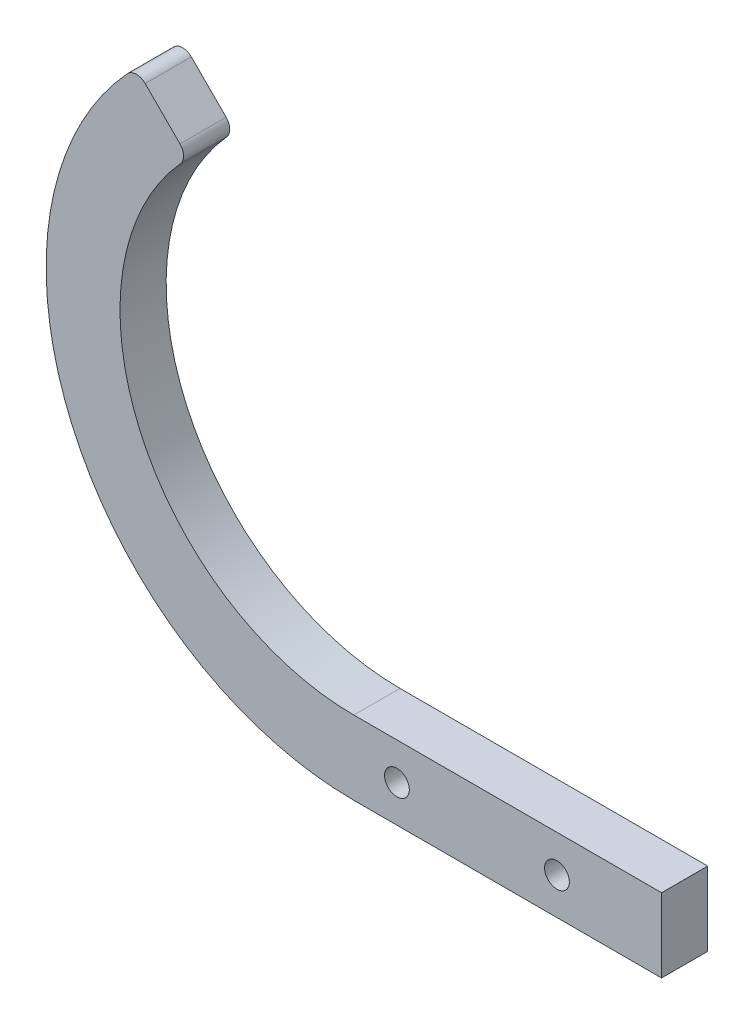
ISO-10303-21;
HEADER;
FILE_DESCRIPTION(('STEP AP214'),'2;1');
FILE_NAME('part.step','',(''),(''),'','','');
FILE_SCHEMA(('AUTOMOTIVE_DESIGN { 1 0 10303 214 1 1 1 1 }'));
ENDSEC;
DATA;
#1=APPLICATION_CONTEXT('core data for automotive mechanical design processes');
#2=APPLICATION_PROTOCOL_DEFINITION('international standard','automotive_design',2000,#1);
#3=PRODUCT_CONTEXT('',#1,'mechanical');
#4=PRODUCT('Part','Part','',(#3));
#5=PRODUCT_RELATED_PRODUCT_CATEGORY('part','',(#4));
#6=PRODUCT_DEFINITION_FORMATION('','',#4);
#7=PRODUCT_DEFINITION_CONTEXT('part definition',#1,'design');
#8=PRODUCT_DEFINITION('design','',#6,#7);
#9=PRODUCT_DEFINITION_SHAPE('','',#8);
#10=(LENGTH_UNIT() NAMED_UNIT(*) SI_UNIT(.MILLI.,.METRE.));
#11=(NAMED_UNIT(*) PLANE_ANGLE_UNIT() SI_UNIT($,.RADIAN.));
#12=(NAMED_UNIT(*) SI_UNIT($,.STERADIAN.) SOLID_ANGLE_UNIT());
#13=UNCERTAINTY_MEASURE_WITH_UNIT(LENGTH_MEASURE(1.E-05),#10,'distance_accuracy_value','');
#14=(GEOMETRIC_REPRESENTATION_CONTEXT(3) GLOBAL_UNCERTAINTY_ASSIGNED_CONTEXT((#13)) GLOBAL_UNIT_ASSIGNED_CONTEXT((#10,
#11,#12)) REPRESENTATION_CONTEXT('',''));
#15=CARTESIAN_POINT('',(0.,0.,0.));
#16=DIRECTION('',(0.,0.,1.));
#17=DIRECTION('',(1.,0.,0.));
#18=AXIS2_PLACEMENT_3D('',#15,#16,#17);
#19=CARTESIAN_POINT('',(-44.8638466170592,41.2717441686317,9.525));
#20=DIRECTION('',(0.,0.,-1.));
#21=DIRECTION('',(-1.,0.,0.));
#22=AXIS2_PLACEMENT_3D('',#19,#20,#21);
#23=CYLINDRICAL_SURFACE('',#22,2.53999999999999);
#24=CARTESIAN_POINT('',(-44.8638466170592,41.2717441686317,0.));
#25=DIRECTION('',(0.,0.,1.));
#26=DIRECTION('',(1.,0.,0.));
#27=AXIS2_PLACEMENT_3D('',#24,#25,#26);
#28=CIRCLE('',#27,2.53999999999999);
#29=CARTESIAN_POINT('',(-43.0677953928454,43.0677953928455,0.));
#30=VERTEX_POINT('',#29);
#31=CARTESIAN_POINT('',(-46.7331735594367,42.991400175658,0.));
#32=VERTEX_POINT('',#31);
#33=EDGE_CURVE('E137',#30,#32,#28,.T.);
#34=ORIENTED_EDGE('',*,*,#33,.T.);
#35=DIRECTION('',(0.,0.,-1.));
#36=VECTOR('',#35,1.);
#37=CARTESIAN_POINT('',(-46.7331735594367,42.991400175658,9.525));
#38=LINE('',#37,#36);
#39=CARTESIAN_POINT('',(-46.7331735594367,42.991400175658,9.525));
#40=VERTEX_POINT('',#39);
#41=EDGE_CURVE('E11',#40,#32,#38,.T.);
#42=ORIENTED_EDGE('',*,*,#41,.F.);
#43=CARTESIAN_POINT('',(-44.8638466170592,41.2717441686317,9.525));
#44=DIRECTION('',(0.,0.,1.));
#45=DIRECTION('',(1.,0.,0.));
#46=AXIS2_PLACEMENT_3D('',#43,#44,#45);
#47=CIRCLE('',#46,2.53999999999999);
#48=CARTESIAN_POINT('',(-43.0677953928454,43.0677953928455,9.525));
#49=VERTEX_POINT('',#48);
#50=EDGE_CURVE('E157',#49,#40,#47,.T.);
#51=ORIENTED_EDGE('',*,*,#50,.F.);
#52=DIRECTION('',(0.,0.,-1.));
#53=VECTOR('',#52,1.);
#54=CARTESIAN_POINT('',(-43.0677953928454,43.0677953928455,9.525));
#55=LINE('',#54,#53);
#56=EDGE_CURVE('E54',#49,#30,#55,.T.);
#57=ORIENTED_EDGE('',*,*,#56,.T.);
#58=EDGE_LOOP('',(#34,#42,#51,#57));
#59=FACE_BOUND('',#58,.T.);
#60=ADVANCED_FACE('F38',(#59),#23,.T.);
#61=CARTESIAN_POINT('',(0.,0.,9.525));
#62=DIRECTION('',(0.,0.,-1.));
#63=DIRECTION('',(-1.,0.,0.));
#64=AXIS2_PLACEMENT_3D('',#61,#62,#63);
#65=CYLINDRICAL_SURFACE('',#64,63.5);
#66=CARTESIAN_POINT('',(0.,0.,0.));
#67=DIRECTION('',(0.,0.,1.));
#68=DIRECTION('',(1.,0.,0.));
#69=AXIS2_PLACEMENT_3D('',#66,#67,#68);
#70=CIRCLE('',#69,63.5);
#71=CARTESIAN_POINT('',(0.,-63.5,0.));
#72=VERTEX_POINT('',#71);
#73=EDGE_CURVE('E139',#32,#72,#70,.T.);
#74=ORIENTED_EDGE('',*,*,#73,.T.);
#75=DIRECTION('',(0.,0.,-1.));
#76=VECTOR('',#75,1.);
#77=CARTESIAN_POINT('',(0.,-63.5,9.525));
#78=LINE('',#77,#76);
#79=CARTESIAN_POINT('',(0.,-63.5,9.525));
#80=VERTEX_POINT('',#79);
#81=EDGE_CURVE('E46',#80,#72,#78,.T.);
#82=ORIENTED_EDGE('',*,*,#81,.F.);
#83=CARTESIAN_POINT('',(0.,0.,9.525));
#84=DIRECTION('',(0.,0.,1.));
#85=DIRECTION('',(1.,0.,0.));
#86=AXIS2_PLACEMENT_3D('',#83,#84,#85);
#87=CIRCLE('',#86,63.5);
#88=EDGE_CURVE('E93',#40,#80,#87,.T.);
#89=ORIENTED_EDGE('',*,*,#88,.F.);
#90=ORIENTED_EDGE('',*,*,#41,.T.);
#91=EDGE_LOOP('',(#74,#82,#89,#90));
#92=FACE_BOUND('',#91,.T.);
#93=ADVANCED_FACE('F216',(#92),#65,.T.);
#94=CARTESIAN_POINT('',(0.,-63.5,9.525));
#95=DIRECTION('',(0.,1.,0.));
#96=DIRECTION('',(0.,0.,1.));
#97=AXIS2_PLACEMENT_3D('',#94,#95,#96);
#98=PLANE('',#97);
#99=DIRECTION('',(1.,0.,0.));
#100=VECTOR('',#99,1.);
#101=CARTESIAN_POINT('',(0.,-63.5,0.));
#102=LINE('',#101,#100);
#103=CARTESIAN_POINT('',(63.5,-63.5,0.));
#104=VERTEX_POINT('',#103);
#105=EDGE_CURVE('E142',#72,#104,#102,.T.);
#106=ORIENTED_EDGE('',*,*,#105,.T.);
#107=DIRECTION('',(0.,0.,-1.));
#108=VECTOR('',#107,1.);
#109=CARTESIAN_POINT('',(63.5,-63.5,9.525));
#110=LINE('',#109,#108);
#111=CARTESIAN_POINT('',(63.5,-63.5,9.525));
#112=VERTEX_POINT('',#111);
#113=EDGE_CURVE('E163',#112,#104,#110,.T.);
#114=ORIENTED_EDGE('',*,*,#113,.F.);
#115=DIRECTION('',(1.,0.,0.));
#116=VECTOR('',#115,1.);
#117=CARTESIAN_POINT('',(0.,-63.5,9.525));
#118=LINE('',#117,#116);
#119=EDGE_CURVE('E170',#80,#112,#118,.T.);
#120=ORIENTED_EDGE('',*,*,#119,.F.);
#121=ORIENTED_EDGE('',*,*,#81,.T.);
#122=EDGE_LOOP('',(#106,#114,#120,#121));
#123=FACE_BOUND('',#122,.T.);
#124=ADVANCED_FACE('F168',(#123),#98,.F.);
#125=CARTESIAN_POINT('',(63.5,-48.26,9.525));
#126=DIRECTION('',(1.,0.,0.));
#127=DIRECTION('',(0.,0.,-1.));
#128=AXIS2_PLACEMENT_3D('',#125,#126,#127);
#129=PLANE('',#128);
#130=DIRECTION('',(0.,-1.,0.));
#131=VECTOR('',#130,1.);
#132=CARTESIAN_POINT('',(63.5,-48.26,0.));
#133=LINE('',#132,#131);
#134=CARTESIAN_POINT('',(63.5,-48.26,0.));
#135=VERTEX_POINT('',#134);
#136=EDGE_CURVE('E145',#135,#104,#133,.T.);
#137=ORIENTED_EDGE('',*,*,#136,.F.);
#138=DIRECTION('',(0.,0.,-1.));
#139=VECTOR('',#138,1.);
#140=CARTESIAN_POINT('',(63.5,-48.26,9.525));
#141=LINE('',#140,#139);
#142=CARTESIAN_POINT('',(63.5,-48.26,9.525));
#143=VERTEX_POINT('',#142);
#144=EDGE_CURVE('E161',#143,#135,#141,.T.);
#145=ORIENTED_EDGE('',*,*,#144,.F.);
#146=DIRECTION('',(0.,-1.,0.));
#147=VECTOR('',#146,1.);
#148=CARTESIAN_POINT('',(63.5,-48.26,9.525));
#149=LINE('',#148,#147);
#150=EDGE_CURVE('E132',#143,#112,#149,.T.);
#151=ORIENTED_EDGE('',*,*,#150,.T.);
#152=ORIENTED_EDGE('',*,*,#113,.T.);
#153=EDGE_LOOP('',(#137,#145,#151,#152));
#154=FACE_BOUND('',#153,.T.);
#155=ADVANCED_FACE('F176',(#154),#129,.T.);
#156=CARTESIAN_POINT('',(0.,-48.26,9.525));
#157=DIRECTION('',(0.,1.,0.));
#158=DIRECTION('',(0.,0.,1.));
#159=AXIS2_PLACEMENT_3D('',#156,#157,#158);
#160=PLANE('',#159);
#161=DIRECTION('',(1.,0.,0.));
#162=VECTOR('',#161,1.);
#163=CARTESIAN_POINT('',(0.,-48.26,0.));
#164=LINE('',#163,#162);
#165=CARTESIAN_POINT('',(0.,-48.26,0.));
#166=VERTEX_POINT('',#165);
#167=EDGE_CURVE('E148',#166,#135,#164,.T.);
#168=ORIENTED_EDGE('',*,*,#167,.F.);
#169=DIRECTION('',(0.,0.,-1.));
#170=VECTOR('',#169,1.);
#171=CARTESIAN_POINT('',(0.,-48.26,9.525));
#172=LINE('',#171,#170);
#173=CARTESIAN_POINT('',(0.,-48.26,9.525));
#174=VERTEX_POINT('',#173);
#175=EDGE_CURVE('E118',#174,#166,#172,.T.);
#176=ORIENTED_EDGE('',*,*,#175,.F.);
#177=DIRECTION('',(1.,0.,0.));
#178=VECTOR('',#177,1.);
#179=CARTESIAN_POINT('',(0.,-48.26,9.525));
#180=LINE('',#179,#178);
#181=EDGE_CURVE('E130',#174,#143,#180,.T.);
#182=ORIENTED_EDGE('',*,*,#181,.T.);
#183=ORIENTED_EDGE('',*,*,#144,.T.);
#184=EDGE_LOOP('',(#168,#176,#182,#183));
#185=FACE_BOUND('',#184,.T.);
#186=ADVANCED_FACE('F230',(#185),#160,.T.);
#187=CARTESIAN_POINT('',(0.,0.,9.525));
#188=DIRECTION('',(0.,0.,-1.));
#189=DIRECTION('',(-1.,0.,0.));
#190=AXIS2_PLACEMENT_3D('',#187,#188,#189);
#191=CYLINDRICAL_SURFACE('',#190,48.26);
#192=CARTESIAN_POINT('',(0.,0.,0.));
#193=DIRECTION('',(0.,0.,1.));
#194=DIRECTION('',(1.,0.,0.));
#195=AXIS2_PLACEMENT_3D('',#192,#193,#194);
#196=CIRCLE('',#195,48.26);
#197=CARTESIAN_POINT('',(-35.7885390129781,32.3760416869719,0.));
#198=VERTEX_POINT('',#197);
#199=EDGE_CURVE('E115',#198,#166,#196,.T.);
#200=ORIENTED_EDGE('',*,*,#199,.F.);
#201=DIRECTION('',(0.,0.,-1.));
#202=VECTOR('',#201,1.);
#203=CARTESIAN_POINT('',(-35.7885390129781,32.3760416869719,9.525));
#204=LINE('',#203,#202);
#205=CARTESIAN_POINT('',(-35.7885390129781,32.3760416869719,9.525));
#206=VERTEX_POINT('',#205);
#207=EDGE_CURVE('E109',#206,#198,#204,.T.);
#208=ORIENTED_EDGE('',*,*,#207,.F.);
#209=CARTESIAN_POINT('',(0.,0.,9.525));
#210=DIRECTION('',(0.,0.,1.));
#211=DIRECTION('',(1.,0.,0.));
#212=AXIS2_PLACEMENT_3D('',#209,#210,#211);
#213=CIRCLE('',#212,48.26);
#214=EDGE_CURVE('E113',#206,#174,#213,.T.);
#215=ORIENTED_EDGE('',*,*,#214,.T.);
#216=ORIENTED_EDGE('',*,*,#175,.T.);
#217=EDGE_LOOP('',(#200,#208,#215,#216));
#218=FACE_BOUND('',#217,.T.);
#219=ADVANCED_FACE('F111',(#218),#191,.F.);
#220=CARTESIAN_POINT('',(-37.6721463294506,34.0800438810231,9.525));
#221=DIRECTION('',(0.,0.,-1.));
#222=DIRECTION('',(-1.,0.,0.));
#223=AXIS2_PLACEMENT_3D('',#220,#221,#222);
#224=CYLINDRICAL_SURFACE('',#223,2.54);
#225=CARTESIAN_POINT('',(-37.6721463294506,34.0800438810231,0.));
#226=DIRECTION('',(0.,0.,1.));
#227=DIRECTION('',(1.,0.,0.));
#228=AXIS2_PLACEMENT_3D('',#225,#226,#227);
#229=CIRCLE('',#228,2.54);
#230=CARTESIAN_POINT('',(-35.8760951052368,35.8760951052369,0.));
#231=VERTEX_POINT('',#230);
#232=EDGE_CURVE('E152',#198,#231,#229,.T.);
#233=ORIENTED_EDGE('',*,*,#232,.T.);
#234=DIRECTION('',(0.,0.,-1.));
#235=VECTOR('',#234,1.);
#236=CARTESIAN_POINT('',(-35.8760951052368,35.8760951052369,9.525));
#237=LINE('',#236,#235);
#238=CARTESIAN_POINT('',(-35.8760951052368,35.8760951052369,9.525));
#239=VERTEX_POINT('',#238);
#240=EDGE_CURVE('E81',#239,#231,#237,.T.);
#241=ORIENTED_EDGE('',*,*,#240,.F.);
#242=CARTESIAN_POINT('',(-37.6721463294506,34.0800438810231,9.525));
#243=DIRECTION('',(0.,0.,1.));
#244=DIRECTION('',(1.,0.,0.));
#245=AXIS2_PLACEMENT_3D('',#242,#243,#244);
#246=CIRCLE('',#245,2.54);
#247=EDGE_CURVE('E120',#206,#239,#246,.T.);
#248=ORIENTED_EDGE('',*,*,#247,.F.);
#249=ORIENTED_EDGE('',*,*,#207,.T.);
#250=EDGE_LOOP('',(#233,#241,#248,#249));
#251=FACE_BOUND('',#250,.T.);
#252=ADVANCED_FACE('F121',(#251),#224,.T.);
#253=CARTESIAN_POINT('',(-43.0677953928454,43.0677953928455,9.525));
#254=DIRECTION('',(0.70710678118655,0.707106781186545,0.));
#255=DIRECTION('',(-0.707106781186545,0.70710678118655,0.));
#256=AXIS2_PLACEMENT_3D('',#253,#254,#255);
#257=PLANE('',#256);
#258=DIRECTION('',(0.707106781186545,-0.70710678118655,0.));
#259=VECTOR('',#258,1.);
#260=CARTESIAN_POINT('',(-43.0677953928454,43.0677953928455,0.));
#261=LINE('',#260,#259);
#262=EDGE_CURVE('E154',#30,#231,#261,.T.);
#263=ORIENTED_EDGE('',*,*,#262,.F.);
#264=ORIENTED_EDGE('',*,*,#56,.F.);
#265=DIRECTION('',(0.707106781186545,-0.70710678118655,0.));
#266=VECTOR('',#265,1.);
#267=CARTESIAN_POINT('',(-43.0677953928454,43.0677953928455,9.525));
#268=LINE('',#267,#266);
#269=EDGE_CURVE('E124',#49,#239,#268,.T.);
#270=ORIENTED_EDGE('',*,*,#269,.T.);
#271=ORIENTED_EDGE('',*,*,#240,.T.);
#272=EDGE_LOOP('',(#263,#264,#270,#271));
#273=FACE_BOUND('',#272,.T.);
#274=ADVANCED_FACE('F198',(#273),#257,.T.);
#275=CARTESIAN_POINT('',(-44.8638466170592,41.2717441686317,9.525));
#276=DIRECTION('',(0.,0.,1.));
#277=DIRECTION('',(1.,0.,0.));
#278=AXIS2_PLACEMENT_3D('',#275,#276,#277);
#279=PLANE('',#278);
#280=CARTESIAN_POINT('',(8.89,-55.88,9.525));
#281=DIRECTION('',(0.,0.,1.));
#282=DIRECTION('',(1.,0.,0.));
#283=AXIS2_PLACEMENT_3D('',#280,#281,#282);
#284=CIRCLE('',#283,2.5527);
#285=CARTESIAN_POINT('',(11.4427,-55.88,9.525));
#286=VERTEX_POINT('',#285);
#287=EDGE_CURVE('E190',#286,#286,#284,.T.);
#288=ORIENTED_EDGE('',*,*,#287,.F.);
#289=EDGE_LOOP('',(#288));
#290=FACE_BOUND('',#289,.T.);
#291=CARTESIAN_POINT('',(41.91,-55.88,9.525));
#292=DIRECTION('',(0.,0.,1.));
#293=DIRECTION('',(1.,0.,0.));
#294=AXIS2_PLACEMENT_3D('',#291,#292,#293);
#295=CIRCLE('',#294,2.5527);
#296=CARTESIAN_POINT('',(44.4627,-55.88,9.525));
#297=VERTEX_POINT('',#296);
#298=EDGE_CURVE('E184',#297,#297,#295,.T.);
#299=ORIENTED_EDGE('',*,*,#298,.F.);
#300=EDGE_LOOP('',(#299));
#301=FACE_BOUND('',#300,.T.);
#302=ORIENTED_EDGE('',*,*,#50,.T.);
#303=ORIENTED_EDGE('',*,*,#88,.T.);
#304=ORIENTED_EDGE('',*,*,#119,.T.);
#305=ORIENTED_EDGE('',*,*,#150,.F.);
#306=ORIENTED_EDGE('',*,*,#181,.F.);
#307=ORIENTED_EDGE('',*,*,#214,.F.);
#308=ORIENTED_EDGE('',*,*,#247,.T.);
#309=ORIENTED_EDGE('',*,*,#269,.F.);
#310=EDGE_LOOP('',(#302,#303,#304,#305,#306,#307,#308,#309));
#311=FACE_BOUND('',#310,.T.);
#312=ADVANCED_FACE('F127',(#290,#301,#311),#279,.T.);
#313=CARTESIAN_POINT('',(-44.8638466170592,41.2717441686317,0.));
#314=DIRECTION('',(0.,0.,1.));
#315=DIRECTION('',(1.,0.,0.));
#316=AXIS2_PLACEMENT_3D('',#313,#314,#315);
#317=PLANE('',#316);
#318=CARTESIAN_POINT('',(8.89,-55.88,0.));
#319=DIRECTION('',(0.,0.,1.));
#320=DIRECTION('',(1.,0.,0.));
#321=AXIS2_PLACEMENT_3D('',#318,#319,#320);
#322=CIRCLE('',#321,2.5527);
#323=CARTESIAN_POINT('',(11.4427,-55.88,0.));
#324=VERTEX_POINT('',#323);
#325=EDGE_CURVE('E187',#324,#324,#322,.T.);
#326=ORIENTED_EDGE('',*,*,#325,.T.);
#327=EDGE_LOOP('',(#326));
#328=FACE_BOUND('',#327,.T.);
#329=CARTESIAN_POINT('',(41.91,-55.88,0.));
#330=DIRECTION('',(0.,0.,1.));
#331=DIRECTION('',(1.,0.,0.));
#332=AXIS2_PLACEMENT_3D('',#329,#330,#331);
#333=CIRCLE('',#332,2.5527);
#334=CARTESIAN_POINT('',(44.4627,-55.88,0.));
#335=VERTEX_POINT('',#334);
#336=EDGE_CURVE('E140',#335,#335,#333,.T.);
#337=ORIENTED_EDGE('',*,*,#336,.T.);
#338=EDGE_LOOP('',(#337));
#339=FACE_BOUND('',#338,.T.);
#340=ORIENTED_EDGE('',*,*,#33,.F.);
#341=ORIENTED_EDGE('',*,*,#262,.T.);
#342=ORIENTED_EDGE('',*,*,#232,.F.);
#343=ORIENTED_EDGE('',*,*,#199,.T.);
#344=ORIENTED_EDGE('',*,*,#167,.T.);
#345=ORIENTED_EDGE('',*,*,#136,.T.);
#346=ORIENTED_EDGE('',*,*,#105,.F.);
#347=ORIENTED_EDGE('',*,*,#73,.F.);
#348=EDGE_LOOP('',(#340,#341,#342,#343,#344,#345,#346,#347));
#349=FACE_BOUND('',#348,.T.);
#350=ADVANCED_FACE('F172',(#328,#339,#349),#317,.F.);
#351=CARTESIAN_POINT('',(41.91,-55.88,9.525));
#352=DIRECTION('',(0.,0.,1.));
#353=DIRECTION('',(1.,0.,0.));
#354=AXIS2_PLACEMENT_3D('',#351,#352,#353);
#355=CYLINDRICAL_SURFACE('',#354,2.5527);
#356=ORIENTED_EDGE('',*,*,#336,.F.);
#357=EDGE_LOOP('',(#356));
#358=FACE_BOUND('',#357,.T.);
#359=ORIENTED_EDGE('',*,*,#298,.T.);
#360=EDGE_LOOP('',(#359));
#361=FACE_BOUND('',#360,.T.);
#362=ADVANCED_FACE('F202',(#358,#361),#355,.F.);
#363=CARTESIAN_POINT('',(8.89,-55.88,9.525));
#364=DIRECTION('',(0.,0.,1.));
#365=DIRECTION('',(1.,0.,0.));
#366=AXIS2_PLACEMENT_3D('',#363,#364,#365);
#367=CYLINDRICAL_SURFACE('',#366,2.5527);
#368=ORIENTED_EDGE('',*,*,#325,.F.);
#369=EDGE_LOOP('',(#368));
#370=FACE_BOUND('',#369,.T.);
#371=ORIENTED_EDGE('',*,*,#287,.T.);
#372=EDGE_LOOP('',(#371));
#373=FACE_BOUND('',#372,.T.);
#374=ADVANCED_FACE('F194',(#370,#373),#367,.F.);
#375=CLOSED_SHELL('',(#60,#93,#124,#155,#186,#219,#252,#274,#312,#350,#362,#374));
#376=MANIFOLD_SOLID_BREP('B2',#375);
#377=ADVANCED_BREP_SHAPE_REPRESENTATION('',(#18,#376),#14);
#378=SHAPE_DEFINITION_REPRESENTATION(#9,#377);
ENDSEC;
END-ISO-10303-21;
